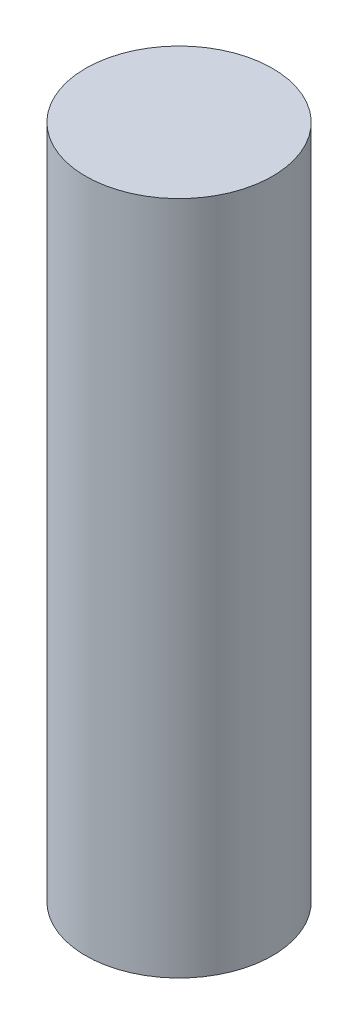
ISO-10303-21;
HEADER;
FILE_DESCRIPTION(('STEP AP214'),'2;1');
FILE_NAME('part.step','',(''),(''),'','','');
FILE_SCHEMA(('AUTOMOTIVE_DESIGN { 1 0 10303 214 1 1 1 1 }'));
ENDSEC;
DATA;
#1=APPLICATION_CONTEXT('core data for automotive mechanical design processes');
#2=APPLICATION_PROTOCOL_DEFINITION('international standard','automotive_design',2000,#1);
#3=PRODUCT_CONTEXT('',#1,'mechanical');
#4=PRODUCT('Part','Part','',(#3));
#5=PRODUCT_RELATED_PRODUCT_CATEGORY('part','',(#4));
#6=PRODUCT_DEFINITION_FORMATION('','',#4);
#7=PRODUCT_DEFINITION_CONTEXT('part definition',#1,'design');
#8=PRODUCT_DEFINITION('design','',#6,#7);
#9=PRODUCT_DEFINITION_SHAPE('','',#8);
#10=(LENGTH_UNIT() NAMED_UNIT(*) SI_UNIT(.MILLI.,.METRE.));
#11=(NAMED_UNIT(*) PLANE_ANGLE_UNIT() SI_UNIT($,.RADIAN.));
#12=(NAMED_UNIT(*) SI_UNIT($,.STERADIAN.) SOLID_ANGLE_UNIT());
#13=UNCERTAINTY_MEASURE_WITH_UNIT(LENGTH_MEASURE(1.E-05),#10,'distance_accuracy_value','');
#14=(GEOMETRIC_REPRESENTATION_CONTEXT(3) GLOBAL_UNCERTAINTY_ASSIGNED_CONTEXT((#13)) GLOBAL_UNIT_ASSIGNED_CONTEXT((#10,
#11,#12)) REPRESENTATION_CONTEXT('',''));
#15=CARTESIAN_POINT('',(0.,0.,0.));
#16=DIRECTION('',(0.,0.,1.));
#17=DIRECTION('',(1.,0.,0.));
#18=AXIS2_PLACEMENT_3D('',#15,#16,#17);
#19=CARTESIAN_POINT('',(0.,0.,0.));
#20=DIRECTION('',(0.,1.,0.));
#21=DIRECTION('',(-1.,0.,0.));
#22=AXIS2_PLACEMENT_3D('',#19,#20,#21);
#23=PLANE('',#22);
#24=CARTESIAN_POINT('',(0.,0.,0.));
#25=DIRECTION('',(0.,1.,0.));
#26=DIRECTION('',(-1.,0.,0.));
#27=AXIS2_PLACEMENT_3D('',#24,#25,#26);
#28=CIRCLE('',#27,9.);
#29=CARTESIAN_POINT('',(-9.,0.,0.));
#30=VERTEX_POINT('',#29);
#31=EDGE_CURVE('E10',#30,#30,#28,.T.);
#32=ORIENTED_EDGE('',*,*,#31,.F.);
#33=EDGE_LOOP('',(#32));
#34=FACE_BOUND('',#33,.T.);
#35=ADVANCED_FACE('F30',(#34),#23,.F.);
#36=CARTESIAN_POINT('',(0.,65.,0.));
#37=DIRECTION('',(0.,1.,0.));
#38=DIRECTION('',(-1.,0.,0.));
#39=AXIS2_PLACEMENT_3D('',#36,#37,#38);
#40=CYLINDRICAL_SURFACE('',#39,9.00000000000001);
#41=CARTESIAN_POINT('',(0.,65.,0.));
#42=DIRECTION('',(0.,1.,0.));
#43=DIRECTION('',(-1.,0.,0.));
#44=AXIS2_PLACEMENT_3D('',#41,#42,#43);
#45=CIRCLE('',#44,9.00000000000001);
#46=CARTESIAN_POINT('',(-9.00000000000001,65.,0.));
#47=VERTEX_POINT('',#46);
#48=EDGE_CURVE('E36',#47,#47,#45,.T.);
#49=ORIENTED_EDGE('',*,*,#48,.F.);
#50=EDGE_LOOP('',(#49));
#51=FACE_BOUND('',#50,.T.);
#52=ORIENTED_EDGE('',*,*,#31,.T.);
#53=EDGE_LOOP('',(#52));
#54=FACE_BOUND('',#53,.T.);
#55=ADVANCED_FACE('F44',(#51,#54),#40,.T.);
#56=CARTESIAN_POINT('',(9.00000000000001,65.,0.));
#57=DIRECTION('',(0.,-1.,0.));
#58=DIRECTION('',(1.,0.,0.));
#59=AXIS2_PLACEMENT_3D('',#56,#57,#58);
#60=PLANE('',#59);
#61=ORIENTED_EDGE('',*,*,#48,.T.);
#62=EDGE_LOOP('',(#61));
#63=FACE_BOUND('',#62,.T.);
#64=ADVANCED_FACE('F42',(#63),#60,.F.);
#65=CLOSED_SHELL('',(#35,#55,#64));
#66=MANIFOLD_SOLID_BREP('B2',#65);
#67=ADVANCED_BREP_SHAPE_REPRESENTATION('',(#18,#66),#14);
#68=SHAPE_DEFINITION_REPRESENTATION(#9,#67);
ENDSEC;
END-ISO-10303-21;
